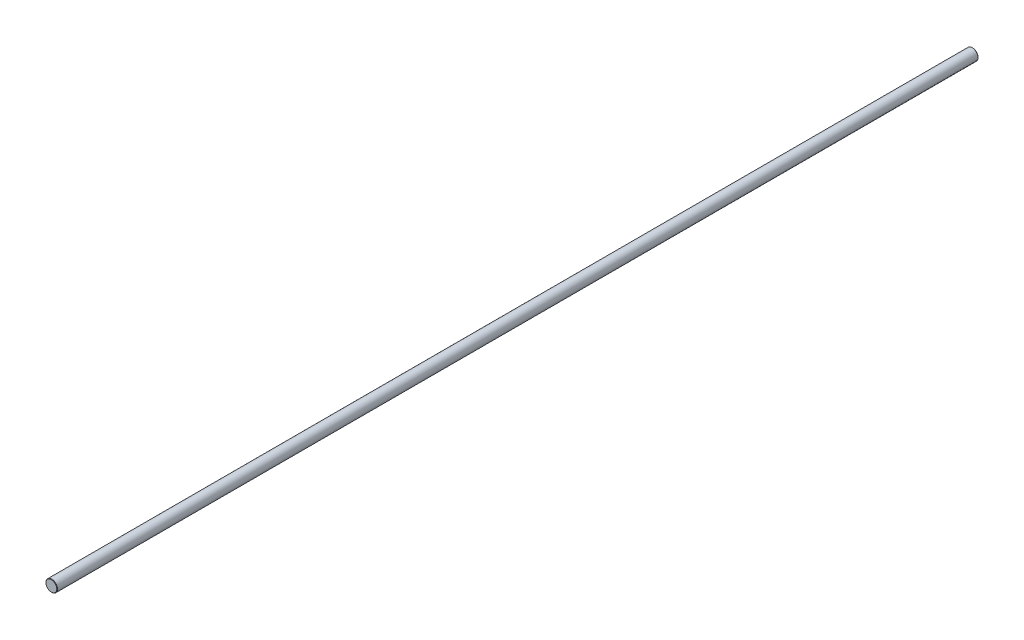
ISO-10303-21;
HEADER;
FILE_DESCRIPTION(('STEP AP214'),'2;1');
FILE_NAME('part.step','',(''),(''),'','','');
FILE_SCHEMA(('AUTOMOTIVE_DESIGN { 1 0 10303 214 1 1 1 1 }'));
ENDSEC;
DATA;
#1=APPLICATION_CONTEXT('core data for automotive mechanical design processes');
#2=APPLICATION_PROTOCOL_DEFINITION('international standard','automotive_design',2000,#1);
#3=PRODUCT_CONTEXT('',#1,'mechanical');
#4=PRODUCT('Part','Part','',(#3));
#5=PRODUCT_RELATED_PRODUCT_CATEGORY('part','',(#4));
#6=PRODUCT_DEFINITION_FORMATION('','',#4);
#7=PRODUCT_DEFINITION_CONTEXT('part definition',#1,'design');
#8=PRODUCT_DEFINITION('design','',#6,#7);
#9=PRODUCT_DEFINITION_SHAPE('','',#8);
#10=(LENGTH_UNIT() NAMED_UNIT(*) SI_UNIT(.MILLI.,.METRE.));
#11=(NAMED_UNIT(*) PLANE_ANGLE_UNIT() SI_UNIT($,.RADIAN.));
#12=(NAMED_UNIT(*) SI_UNIT($,.STERADIAN.) SOLID_ANGLE_UNIT());
#13=UNCERTAINTY_MEASURE_WITH_UNIT(LENGTH_MEASURE(1.E-05),#10,'distance_accuracy_value','');
#14=(GEOMETRIC_REPRESENTATION_CONTEXT(3) GLOBAL_UNCERTAINTY_ASSIGNED_CONTEXT((#13)) GLOBAL_UNIT_ASSIGNED_CONTEXT((#10,
#11,#12)) REPRESENTATION_CONTEXT('',''));
#15=CARTESIAN_POINT('',(0.,0.,0.));
#16=DIRECTION('',(0.,0.,1.));
#17=DIRECTION('',(1.,0.,0.));
#18=AXIS2_PLACEMENT_3D('',#15,#16,#17);
#19=CARTESIAN_POINT('',(0.,0.,640.));
#20=DIRECTION('',(0.,0.,-1.));
#21=DIRECTION('',(-1.,0.,0.));
#22=AXIS2_PLACEMENT_3D('',#19,#20,#21);
#23=CYLINDRICAL_SURFACE('',#22,4.);
#24=CARTESIAN_POINT('',(0.,0.,0.250000000000195));
#25=DIRECTION('',(0.,0.,1.));
#26=DIRECTION('',(1.,0.,0.));
#27=AXIS2_PLACEMENT_3D('',#24,#25,#26);
#28=CIRCLE('',#27,4.);
#29=CARTESIAN_POINT('',(4.,0.,0.250000000000195));
#30=VERTEX_POINT('',#29);
#31=EDGE_CURVE('E45',#30,#30,#28,.T.);
#32=ORIENTED_EDGE('',*,*,#31,.T.);
#33=EDGE_LOOP('',(#32));
#34=FACE_BOUND('',#33,.T.);
#35=CARTESIAN_POINT('',(0.,0.,639.75));
#36=DIRECTION('',(0.,0.,1.));
#37=DIRECTION('',(1.,0.,0.));
#38=AXIS2_PLACEMENT_3D('',#35,#36,#37);
#39=CIRCLE('',#38,4.);
#40=CARTESIAN_POINT('',(4.,0.,639.75));
#41=VERTEX_POINT('',#40);
#42=EDGE_CURVE('E49',#41,#41,#39,.F.);
#43=ORIENTED_EDGE('',*,*,#42,.T.);
#44=EDGE_LOOP('',(#43));
#45=FACE_BOUND('',#44,.T.);
#46=ADVANCED_FACE('F33',(#34,#45),#23,.T.);
#47=CARTESIAN_POINT('',(0.,0.,640.));
#48=DIRECTION('',(0.,0.,1.));
#49=DIRECTION('',(1.,0.,0.));
#50=AXIS2_PLACEMENT_3D('',#47,#48,#49);
#51=PLANE('',#50);
#52=CARTESIAN_POINT('',(0.,0.,640.));
#53=DIRECTION('',(0.,0.,1.));
#54=DIRECTION('',(1.,0.,0.));
#55=AXIS2_PLACEMENT_3D('',#52,#53,#54);
#56=CIRCLE('',#55,3.74999999999992);
#57=CARTESIAN_POINT('',(3.74999999999992,0.,640.));
#58=VERTEX_POINT('',#57);
#59=EDGE_CURVE('E10',#58,#58,#56,.T.);
#60=ORIENTED_EDGE('',*,*,#59,.T.);
#61=EDGE_LOOP('',(#60));
#62=FACE_BOUND('',#61,.T.);
#63=ADVANCED_FACE('F65',(#62),#51,.T.);
#64=CARTESIAN_POINT('',(0.,0.,0.));
#65=DIRECTION('',(0.,0.,1.));
#66=DIRECTION('',(1.,0.,0.));
#67=AXIS2_PLACEMENT_3D('',#64,#65,#66);
#68=PLANE('',#67);
#69=CARTESIAN_POINT('',(0.,0.,0.));
#70=DIRECTION('',(0.,0.,1.));
#71=DIRECTION('',(1.,0.,0.));
#72=AXIS2_PLACEMENT_3D('',#69,#70,#71);
#73=CIRCLE('',#72,3.74999999999975);
#74=CARTESIAN_POINT('',(3.74999999999975,0.,0.));
#75=VERTEX_POINT('',#74);
#76=EDGE_CURVE('E41',#75,#75,#73,.F.);
#77=ORIENTED_EDGE('',*,*,#76,.T.);
#78=EDGE_LOOP('',(#77));
#79=FACE_BOUND('',#78,.T.);
#80=ADVANCED_FACE('F62',(#79),#68,.F.);
#81=CARTESIAN_POINT('',(0.,0.,0.250000000000195));
#82=DIRECTION('',(0.,0.,1.));
#83=DIRECTION('',(1.,0.,0.));
#84=AXIS2_PLACEMENT_3D('',#81,#82,#83);
#85=CONICAL_SURFACE('',#84,4.,0.785398163397552);
#86=ORIENTED_EDGE('',*,*,#76,.F.);
#87=EDGE_LOOP('',(#86));
#88=FACE_BOUND('',#87,.T.);
#89=ORIENTED_EDGE('',*,*,#31,.F.);
#90=EDGE_LOOP('',(#89));
#91=FACE_BOUND('',#90,.T.);
#92=ADVANCED_FACE('F58',(#88,#91),#85,.T.);
#93=CARTESIAN_POINT('',(0.,0.,640.));
#94=DIRECTION('',(0.,0.,-1.));
#95=DIRECTION('',(-1.,0.,0.));
#96=AXIS2_PLACEMENT_3D('',#93,#94,#95);
#97=CONICAL_SURFACE('',#96,3.74999999999992,0.785398163397441);
#98=ORIENTED_EDGE('',*,*,#42,.F.);
#99=EDGE_LOOP('',(#98));
#100=FACE_BOUND('',#99,.T.);
#101=ORIENTED_EDGE('',*,*,#59,.F.);
#102=EDGE_LOOP('',(#101));
#103=FACE_BOUND('',#102,.T.);
#104=ADVANCED_FACE('F36',(#100,#103),#97,.T.);
#105=CLOSED_SHELL('',(#46,#63,#80,#92,#104));
#106=MANIFOLD_SOLID_BREP('B2',#105);
#107=ADVANCED_BREP_SHAPE_REPRESENTATION('',(#18,#106),#14);
#108=SHAPE_DEFINITION_REPRESENTATION(#9,#107);
ENDSEC;
END-ISO-10303-21;
